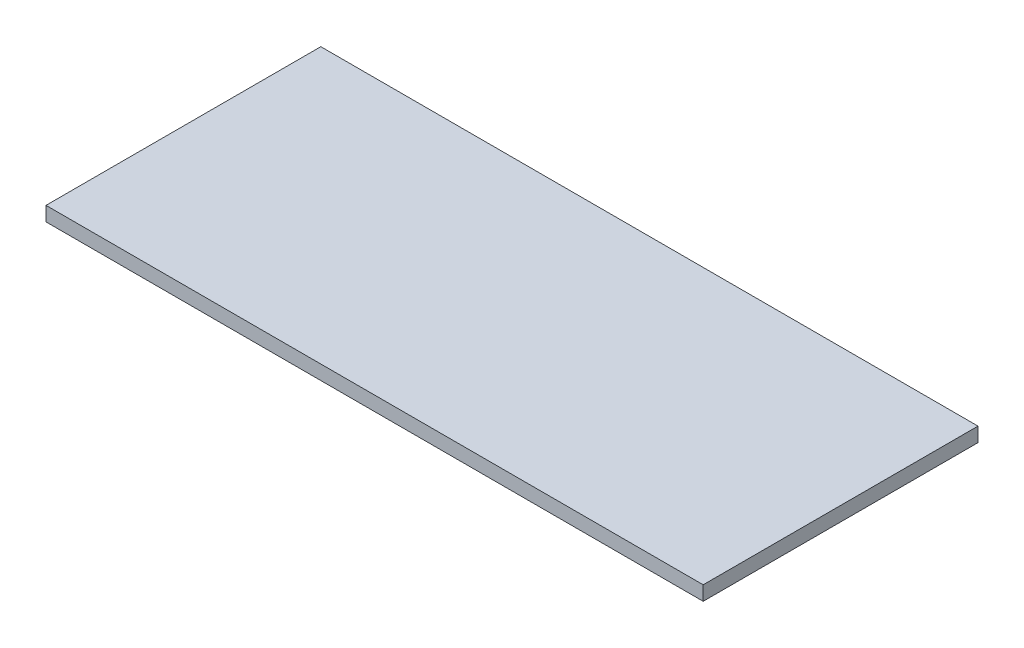
ISO-10303-21;
HEADER;
FILE_DESCRIPTION(('STEP AP214'),'2;1');
FILE_NAME('part.step','',(''),(''),'','','');
FILE_SCHEMA(('AUTOMOTIVE_DESIGN { 1 0 10303 214 1 1 1 1 }'));
ENDSEC;
DATA;
#1=APPLICATION_CONTEXT('core data for automotive mechanical design processes');
#2=APPLICATION_PROTOCOL_DEFINITION('international standard','automotive_design',2000,#1);
#3=PRODUCT_CONTEXT('',#1,'mechanical');
#4=PRODUCT('Part','Part','',(#3));
#5=PRODUCT_RELATED_PRODUCT_CATEGORY('part','',(#4));
#6=PRODUCT_DEFINITION_FORMATION('','',#4);
#7=PRODUCT_DEFINITION_CONTEXT('part definition',#1,'design');
#8=PRODUCT_DEFINITION('design','',#6,#7);
#9=PRODUCT_DEFINITION_SHAPE('','',#8);
#10=(LENGTH_UNIT() NAMED_UNIT(*) SI_UNIT(.MILLI.,.METRE.));
#11=(NAMED_UNIT(*) PLANE_ANGLE_UNIT() SI_UNIT($,.RADIAN.));
#12=(NAMED_UNIT(*) SI_UNIT($,.STERADIAN.) SOLID_ANGLE_UNIT());
#13=UNCERTAINTY_MEASURE_WITH_UNIT(LENGTH_MEASURE(1.E-05),#10,'distance_accuracy_value','');
#14=(GEOMETRIC_REPRESENTATION_CONTEXT(3) GLOBAL_UNCERTAINTY_ASSIGNED_CONTEXT((#13)) GLOBAL_UNIT_ASSIGNED_CONTEXT((#10,
#11,#12)) REPRESENTATION_CONTEXT('',''));
#15=CARTESIAN_POINT('',(0.,0.,0.));
#16=DIRECTION('',(0.,0.,1.));
#17=DIRECTION('',(1.,0.,0.));
#18=AXIS2_PLACEMENT_3D('',#15,#16,#17);
#19=CARTESIAN_POINT('',(436.5625,19.05,182.5625));
#20=DIRECTION('',(-1.,0.,0.));
#21=DIRECTION('',(0.,0.,1.));
#22=AXIS2_PLACEMENT_3D('',#19,#20,#21);
#23=PLANE('',#22);
#24=DIRECTION('',(0.,0.,-1.));
#25=VECTOR('',#24,1.);
#26=CARTESIAN_POINT('',(436.5625,0.,182.5625));
#27=LINE('',#26,#25);
#28=CARTESIAN_POINT('',(436.5625,0.,182.5625));
#29=VERTEX_POINT('',#28);
#30=CARTESIAN_POINT('',(436.5625,0.,-182.5625));
#31=VERTEX_POINT('',#30);
#32=EDGE_CURVE('E107',#29,#31,#27,.T.);
#33=ORIENTED_EDGE('',*,*,#32,.T.);
#34=DIRECTION('',(0.,-1.,0.));
#35=VECTOR('',#34,1.);
#36=CARTESIAN_POINT('',(436.5625,19.05,-182.5625));
#37=LINE('',#36,#35);
#38=CARTESIAN_POINT('',(436.5625,19.05,-182.5625));
#39=VERTEX_POINT('',#38);
#40=EDGE_CURVE('E11',#39,#31,#37,.T.);
#41=ORIENTED_EDGE('',*,*,#40,.F.);
#42=DIRECTION('',(0.,0.,-1.));
#43=VECTOR('',#42,1.);
#44=CARTESIAN_POINT('',(436.5625,19.05,182.5625));
#45=LINE('',#44,#43);
#46=CARTESIAN_POINT('',(436.5625,19.05,182.5625));
#47=VERTEX_POINT('',#46);
#48=EDGE_CURVE('E91',#47,#39,#45,.T.);
#49=ORIENTED_EDGE('',*,*,#48,.F.);
#50=DIRECTION('',(0.,-1.,0.));
#51=VECTOR('',#50,1.);
#52=CARTESIAN_POINT('',(436.5625,19.05,182.5625));
#53=LINE('',#52,#51);
#54=EDGE_CURVE('E103',#47,#29,#53,.T.);
#55=ORIENTED_EDGE('',*,*,#54,.T.);
#56=EDGE_LOOP('',(#33,#41,#49,#55));
#57=FACE_BOUND('',#56,.T.);
#58=ADVANCED_FACE('F39',(#57),#23,.F.);
#59=CARTESIAN_POINT('',(-436.5625,19.05,-182.5625));
#60=DIRECTION('',(0.,0.,1.));
#61=DIRECTION('',(1.,0.,0.));
#62=AXIS2_PLACEMENT_3D('',#59,#60,#61);
#63=PLANE('',#62);
#64=DIRECTION('',(-1.,0.,0.));
#65=VECTOR('',#64,1.);
#66=CARTESIAN_POINT('',(-436.5625,0.,-182.5625));
#67=LINE('',#66,#65);
#68=CARTESIAN_POINT('',(-436.5625,0.,-182.5625));
#69=VERTEX_POINT('',#68);
#70=EDGE_CURVE('E96',#31,#69,#67,.T.);
#71=ORIENTED_EDGE('',*,*,#70,.T.);
#72=DIRECTION('',(0.,-1.,0.));
#73=VECTOR('',#72,1.);
#74=CARTESIAN_POINT('',(-436.5625,19.05,-182.5625));
#75=LINE('',#74,#73);
#76=CARTESIAN_POINT('',(-436.5625,19.05,-182.5625));
#77=VERTEX_POINT('',#76);
#78=EDGE_CURVE('E48',#77,#69,#75,.T.);
#79=ORIENTED_EDGE('',*,*,#78,.F.);
#80=DIRECTION('',(-1.,0.,0.));
#81=VECTOR('',#80,1.);
#82=CARTESIAN_POINT('',(-436.5625,19.05,-182.5625));
#83=LINE('',#82,#81);
#84=EDGE_CURVE('E86',#39,#77,#83,.T.);
#85=ORIENTED_EDGE('',*,*,#84,.F.);
#86=ORIENTED_EDGE('',*,*,#40,.T.);
#87=EDGE_LOOP('',(#71,#79,#85,#86));
#88=FACE_BOUND('',#87,.T.);
#89=ADVANCED_FACE('F95',(#88),#63,.F.);
#90=CARTESIAN_POINT('',(-436.5625,19.05,182.5625));
#91=DIRECTION('',(1.,0.,0.));
#92=DIRECTION('',(0.,0.,-1.));
#93=AXIS2_PLACEMENT_3D('',#90,#91,#92);
#94=PLANE('',#93);
#95=DIRECTION('',(0.,0.,1.));
#96=VECTOR('',#95,1.);
#97=CARTESIAN_POINT('',(-436.5625,0.,182.5625));
#98=LINE('',#97,#96);
#99=CARTESIAN_POINT('',(-436.5625,0.,182.5625));
#100=VERTEX_POINT('',#99);
#101=EDGE_CURVE('E73',#69,#100,#98,.T.);
#102=ORIENTED_EDGE('',*,*,#101,.T.);
#103=DIRECTION('',(0.,-1.,0.));
#104=VECTOR('',#103,1.);
#105=CARTESIAN_POINT('',(-436.5625,19.05,182.5625));
#106=LINE('',#105,#104);
#107=CARTESIAN_POINT('',(-436.5625,19.05,182.5625));
#108=VERTEX_POINT('',#107);
#109=EDGE_CURVE('E98',#108,#100,#106,.T.);
#110=ORIENTED_EDGE('',*,*,#109,.F.);
#111=DIRECTION('',(0.,0.,1.));
#112=VECTOR('',#111,1.);
#113=CARTESIAN_POINT('',(-436.5625,19.05,182.5625));
#114=LINE('',#113,#112);
#115=EDGE_CURVE('E89',#77,#108,#114,.T.);
#116=ORIENTED_EDGE('',*,*,#115,.F.);
#117=ORIENTED_EDGE('',*,*,#78,.T.);
#118=EDGE_LOOP('',(#102,#110,#116,#117));
#119=FACE_BOUND('',#118,.T.);
#120=ADVANCED_FACE('F99',(#119),#94,.F.);
#121=CARTESIAN_POINT('',(-436.5625,19.05,182.5625));
#122=DIRECTION('',(0.,0.,-1.));
#123=DIRECTION('',(-1.,0.,0.));
#124=AXIS2_PLACEMENT_3D('',#121,#122,#123);
#125=PLANE('',#124);
#126=DIRECTION('',(1.,0.,0.));
#127=VECTOR('',#126,1.);
#128=CARTESIAN_POINT('',(-436.5625,0.,182.5625));
#129=LINE('',#128,#127);
#130=EDGE_CURVE('E79',#100,#29,#129,.T.);
#131=ORIENTED_EDGE('',*,*,#130,.T.);
#132=ORIENTED_EDGE('',*,*,#54,.F.);
#133=DIRECTION('',(1.,0.,0.));
#134=VECTOR('',#133,1.);
#135=CARTESIAN_POINT('',(-436.5625,19.05,182.5625));
#136=LINE('',#135,#134);
#137=EDGE_CURVE('E56',#108,#47,#136,.T.);
#138=ORIENTED_EDGE('',*,*,#137,.F.);
#139=ORIENTED_EDGE('',*,*,#109,.T.);
#140=EDGE_LOOP('',(#131,#132,#138,#139));
#141=FACE_BOUND('',#140,.T.);
#142=ADVANCED_FACE('F120',(#141),#125,.F.);
#143=CARTESIAN_POINT('',(0.,19.05,0.));
#144=DIRECTION('',(0.,-1.,0.));
#145=DIRECTION('',(0.,0.,-1.));
#146=AXIS2_PLACEMENT_3D('',#143,#144,#145);
#147=PLANE('',#146);
#148=ORIENTED_EDGE('',*,*,#48,.T.);
#149=ORIENTED_EDGE('',*,*,#84,.T.);
#150=ORIENTED_EDGE('',*,*,#115,.T.);
#151=ORIENTED_EDGE('',*,*,#137,.T.);
#152=EDGE_LOOP('',(#148,#149,#150,#151));
#153=FACE_BOUND('',#152,.T.);
#154=ADVANCED_FACE('F87',(#153),#147,.F.);
#155=CARTESIAN_POINT('',(0.,0.,0.));
#156=DIRECTION('',(0.,-1.,0.));
#157=DIRECTION('',(0.,0.,-1.));
#158=AXIS2_PLACEMENT_3D('',#155,#156,#157);
#159=PLANE('',#158);
#160=ORIENTED_EDGE('',*,*,#32,.F.);
#161=ORIENTED_EDGE('',*,*,#130,.F.);
#162=ORIENTED_EDGE('',*,*,#101,.F.);
#163=ORIENTED_EDGE('',*,*,#70,.F.);
#164=EDGE_LOOP('',(#160,#161,#162,#163));
#165=FACE_BOUND('',#164,.T.);
#166=ADVANCED_FACE('F123',(#165),#159,.T.);
#167=CLOSED_SHELL('',(#58,#89,#120,#142,#154,#166));
#168=MANIFOLD_SOLID_BREP('B2',#167);
#169=ADVANCED_BREP_SHAPE_REPRESENTATION('',(#18,#168),#14);
#170=SHAPE_DEFINITION_REPRESENTATION(#9,#169);
ENDSEC;
END-ISO-10303-21;
